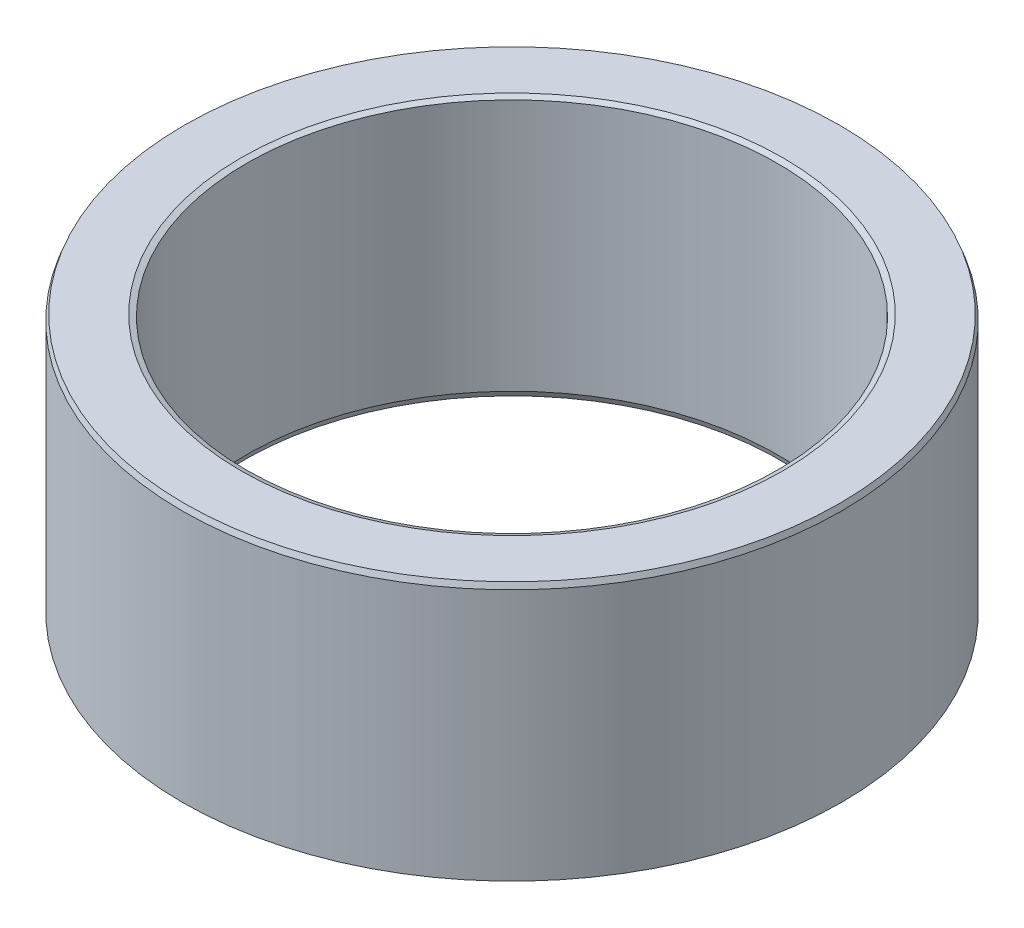
ISO-10303-21;
HEADER;
FILE_DESCRIPTION(('STEP AP214'),'2;1');
FILE_NAME('part.step','',(''),(''),'','','');
FILE_SCHEMA(('AUTOMOTIVE_DESIGN { 1 0 10303 214 1 1 1 1 }'));
ENDSEC;
DATA;
#1=APPLICATION_CONTEXT('core data for automotive mechanical design processes');
#2=APPLICATION_PROTOCOL_DEFINITION('international standard','automotive_design',2000,#1);
#3=PRODUCT_CONTEXT('',#1,'mechanical');
#4=PRODUCT('Part','Part','',(#3));
#5=PRODUCT_RELATED_PRODUCT_CATEGORY('part','',(#4));
#6=PRODUCT_DEFINITION_FORMATION('','',#4);
#7=PRODUCT_DEFINITION_CONTEXT('part definition',#1,'design');
#8=PRODUCT_DEFINITION('design','',#6,#7);
#9=PRODUCT_DEFINITION_SHAPE('','',#8);
#10=(LENGTH_UNIT() NAMED_UNIT(*) SI_UNIT(.MILLI.,.METRE.));
#11=(NAMED_UNIT(*) PLANE_ANGLE_UNIT() SI_UNIT($,.RADIAN.));
#12=(NAMED_UNIT(*) SI_UNIT($,.STERADIAN.) SOLID_ANGLE_UNIT());
#13=UNCERTAINTY_MEASURE_WITH_UNIT(LENGTH_MEASURE(1.E-05),#10,'distance_accuracy_value','');
#14=(GEOMETRIC_REPRESENTATION_CONTEXT(3) GLOBAL_UNCERTAINTY_ASSIGNED_CONTEXT((#13)) GLOBAL_UNIT_ASSIGNED_CONTEXT((#10,
#11,#12)) REPRESENTATION_CONTEXT('',''));
#15=CARTESIAN_POINT('',(0.,0.,0.));
#16=DIRECTION('',(0.,0.,1.));
#17=DIRECTION('',(1.,0.,0.));
#18=AXIS2_PLACEMENT_3D('',#15,#16,#17);
#19=CARTESIAN_POINT('',(0.,45.3268893818058,0.));
#20=DIRECTION('',(0.,-1.,0.));
#21=DIRECTION('',(0.,0.,-1.));
#22=AXIS2_PLACEMENT_3D('',#19,#20,#21);
#23=CYLINDRICAL_SURFACE('',#22,57.5);
#24=CARTESIAN_POINT('',(0.,0.363444750903136,0.));
#25=DIRECTION('',(0.,1.,0.));
#26=DIRECTION('',(0.,0.,1.));
#27=AXIS2_PLACEMENT_3D('',#24,#25,#26);
#28=CIRCLE('',#27,57.5);
#29=CARTESIAN_POINT('',(0.,0.363444750903136,57.5));
#30=VERTEX_POINT('',#29);
#31=EDGE_CURVE('E10',#30,#30,#28,.T.);
#32=ORIENTED_EDGE('',*,*,#31,.T.);
#33=EDGE_LOOP('',(#32));
#34=FACE_BOUND('',#33,.T.);
#35=CARTESIAN_POINT('',(0.,44.3723775576549,0.));
#36=DIRECTION('',(0.,1.,0.));
#37=DIRECTION('',(0.,0.,1.));
#38=AXIS2_PLACEMENT_3D('',#35,#36,#37);
#39=CIRCLE('',#38,57.5);
#40=CARTESIAN_POINT('',(0.,44.3723775576549,57.5));
#41=VERTEX_POINT('',#40);
#42=EDGE_CURVE('E50',#41,#41,#39,.F.);
#43=ORIENTED_EDGE('',*,*,#42,.T.);
#44=EDGE_LOOP('',(#43));
#45=FACE_BOUND('',#44,.T.);
#46=ADVANCED_FACE('F39',(#34,#45),#23,.T.);
#47=CARTESIAN_POINT('',(0.,45.3268893818058,0.));
#48=DIRECTION('',(0.,1.,0.));
#49=DIRECTION('',(0.,0.,1.));
#50=AXIS2_PLACEMENT_3D('',#47,#48,#49);
#51=PLANE('',#50);
#52=CARTESIAN_POINT('',(0.,45.3268893818058,0.));
#53=DIRECTION('',(0.,1.,0.));
#54=DIRECTION('',(0.,0.,1.));
#55=AXIS2_PLACEMENT_3D('',#52,#53,#54);
#56=CIRCLE('',#55,47.2724817584656);
#57=CARTESIAN_POINT('',(0.,45.3268893818058,47.2724817584656));
#58=VERTEX_POINT('',#57);
#59=EDGE_CURVE('E58',#58,#58,#56,.F.);
#60=ORIENTED_EDGE('',*,*,#59,.T.);
#61=EDGE_LOOP('',(#60));
#62=FACE_BOUND('',#61,.T.);
#63=CARTESIAN_POINT('',(0.,45.3268893818058,0.));
#64=DIRECTION('',(0.,1.,0.));
#65=DIRECTION('',(0.,0.,1.));
#66=AXIS2_PLACEMENT_3D('',#63,#64,#65);
#67=CIRCLE('',#66,57.1365552490969);
#68=CARTESIAN_POINT('',(0.,45.3268893818058,57.1365552490969));
#69=VERTEX_POINT('',#68);
#70=EDGE_CURVE('E61',#69,#69,#67,.T.);
#71=ORIENTED_EDGE('',*,*,#70,.T.);
#72=EDGE_LOOP('',(#71));
#73=FACE_BOUND('',#72,.T.);
#74=ADVANCED_FACE('F88',(#62,#73),#51,.T.);
#75=CARTESIAN_POINT('',(0.,0.,0.));
#76=DIRECTION('',(0.,1.,0.));
#77=DIRECTION('',(0.,0.,1.));
#78=AXIS2_PLACEMENT_3D('',#75,#76,#77);
#79=PLANE('',#78);
#80=CARTESIAN_POINT('',(0.,0.,0.));
#81=DIRECTION('',(0.,1.,0.));
#82=DIRECTION('',(0.,0.,1.));
#83=AXIS2_PLACEMENT_3D('',#80,#81,#82);
#84=CIRCLE('',#83,46.6814146852177);
#85=CARTESIAN_POINT('',(0.,0.,46.6814146852177));
#86=VERTEX_POINT('',#85);
#87=EDGE_CURVE('E51',#86,#86,#84,.T.);
#88=ORIENTED_EDGE('',*,*,#87,.T.);
#89=EDGE_LOOP('',(#88));
#90=FACE_BOUND('',#89,.T.);
#91=CARTESIAN_POINT('',(0.,0.,0.));
#92=DIRECTION('',(0.,1.,0.));
#93=DIRECTION('',(0.,0.,1.));
#94=AXIS2_PLACEMENT_3D('',#91,#92,#93);
#95=CIRCLE('',#94,56.5454881758491);
#96=CARTESIAN_POINT('',(0.,0.,56.5454881758491));
#97=VERTEX_POINT('',#96);
#98=EDGE_CURVE('E54',#97,#97,#95,.F.);
#99=ORIENTED_EDGE('',*,*,#98,.T.);
#100=EDGE_LOOP('',(#99));
#101=FACE_BOUND('',#100,.T.);
#102=ADVANCED_FACE('F83',(#90,#101),#79,.F.);
#103=CARTESIAN_POINT('',(0.,45.3268893818058,0.));
#104=DIRECTION('',(0.,-1.,0.));
#105=DIRECTION('',(0.,0.,-1.));
#106=AXIS2_PLACEMENT_3D('',#103,#104,#105);
#107=CYLINDRICAL_SURFACE('',#106,46.3179699343146);
#108=CARTESIAN_POINT('',(0.,44.9634446309026,0.));
#109=DIRECTION('',(0.,1.,0.));
#110=DIRECTION('',(0.,0.,1.));
#111=AXIS2_PLACEMENT_3D('',#108,#109,#110);
#112=CIRCLE('',#111,46.3179699343146);
#113=CARTESIAN_POINT('',(0.,44.9634446309026,46.3179699343146));
#114=VERTEX_POINT('',#113);
#115=EDGE_CURVE('E67',#114,#114,#112,.T.);
#116=ORIENTED_EDGE('',*,*,#115,.T.);
#117=EDGE_LOOP('',(#116));
#118=FACE_BOUND('',#117,.T.);
#119=CARTESIAN_POINT('',(0.,0.954511824150947,0.));
#120=DIRECTION('',(0.,1.,0.));
#121=DIRECTION('',(0.,0.,1.));
#122=AXIS2_PLACEMENT_3D('',#119,#120,#121);
#123=CIRCLE('',#122,46.3179699343146);
#124=CARTESIAN_POINT('',(0.,0.954511824150947,46.3179699343146));
#125=VERTEX_POINT('',#124);
#126=EDGE_CURVE('E69',#125,#125,#123,.F.);
#127=ORIENTED_EDGE('',*,*,#126,.T.);
#128=EDGE_LOOP('',(#127));
#129=FACE_BOUND('',#128,.T.);
#130=ADVANCED_FACE('F71',(#118,#129),#107,.F.);
#131=CARTESIAN_POINT('',(0.,44.9634446309026,0.));
#132=DIRECTION('',(0.,1.,0.));
#133=DIRECTION('',(0.,0.,1.));
#134=AXIS2_PLACEMENT_3D('',#131,#132,#133);
#135=CONICAL_SURFACE('',#134,46.3179699343146,1.20698096274331);
#136=ORIENTED_EDGE('',*,*,#59,.F.);
#137=EDGE_LOOP('',(#136));
#138=FACE_BOUND('',#137,.T.);
#139=ORIENTED_EDGE('',*,*,#115,.F.);
#140=EDGE_LOOP('',(#139));
#141=FACE_BOUND('',#140,.T.);
#142=ADVANCED_FACE('F77',(#138,#141),#135,.F.);
#143=CARTESIAN_POINT('',(0.,0.,0.));
#144=DIRECTION('',(0.,-1.,0.));
#145=DIRECTION('',(0.,0.,-1.));
#146=AXIS2_PLACEMENT_3D('',#143,#144,#145);
#147=CONICAL_SURFACE('',#146,46.6814146852177,0.363815364051586);
#148=ORIENTED_EDGE('',*,*,#126,.F.);
#149=EDGE_LOOP('',(#148));
#150=FACE_BOUND('',#149,.T.);
#151=ORIENTED_EDGE('',*,*,#87,.F.);
#152=EDGE_LOOP('',(#151));
#153=FACE_BOUND('',#152,.T.);
#154=ADVANCED_FACE('F73',(#150,#153),#147,.F.);
#155=CARTESIAN_POINT('',(0.,0.363444750903136,0.));
#156=DIRECTION('',(0.,1.,0.));
#157=DIRECTION('',(0.,0.,1.));
#158=AXIS2_PLACEMENT_3D('',#155,#156,#157);
#159=CONICAL_SURFACE('',#158,57.5,1.20698096274332);
#160=ORIENTED_EDGE('',*,*,#98,.F.);
#161=EDGE_LOOP('',(#160));
#162=FACE_BOUND('',#161,.T.);
#163=ORIENTED_EDGE('',*,*,#31,.F.);
#164=EDGE_LOOP('',(#163));
#165=FACE_BOUND('',#164,.T.);
#166=ADVANCED_FACE('F76',(#162,#165),#159,.T.);
#167=CARTESIAN_POINT('',(0.,45.3268893818058,0.));
#168=DIRECTION('',(0.,-1.,0.));
#169=DIRECTION('',(0.,0.,-1.));
#170=AXIS2_PLACEMENT_3D('',#167,#168,#169);
#171=CONICAL_SURFACE('',#170,57.1365552490969,0.363815364051588);
#172=ORIENTED_EDGE('',*,*,#42,.F.);
#173=EDGE_LOOP('',(#172));
#174=FACE_BOUND('',#173,.T.);
#175=ORIENTED_EDGE('',*,*,#70,.F.);
#176=EDGE_LOOP('',(#175));
#177=FACE_BOUND('',#176,.T.);
#178=ADVANCED_FACE('F45',(#174,#177),#171,.T.);
#179=CLOSED_SHELL('',(#46,#74,#102,#130,#142,#154,#166,#178));
#180=MANIFOLD_SOLID_BREP('B2',#179);
#181=ADVANCED_BREP_SHAPE_REPRESENTATION('',(#18,#180),#14);
#182=SHAPE_DEFINITION_REPRESENTATION(#9,#181);
ENDSEC;
END-ISO-10303-21;
